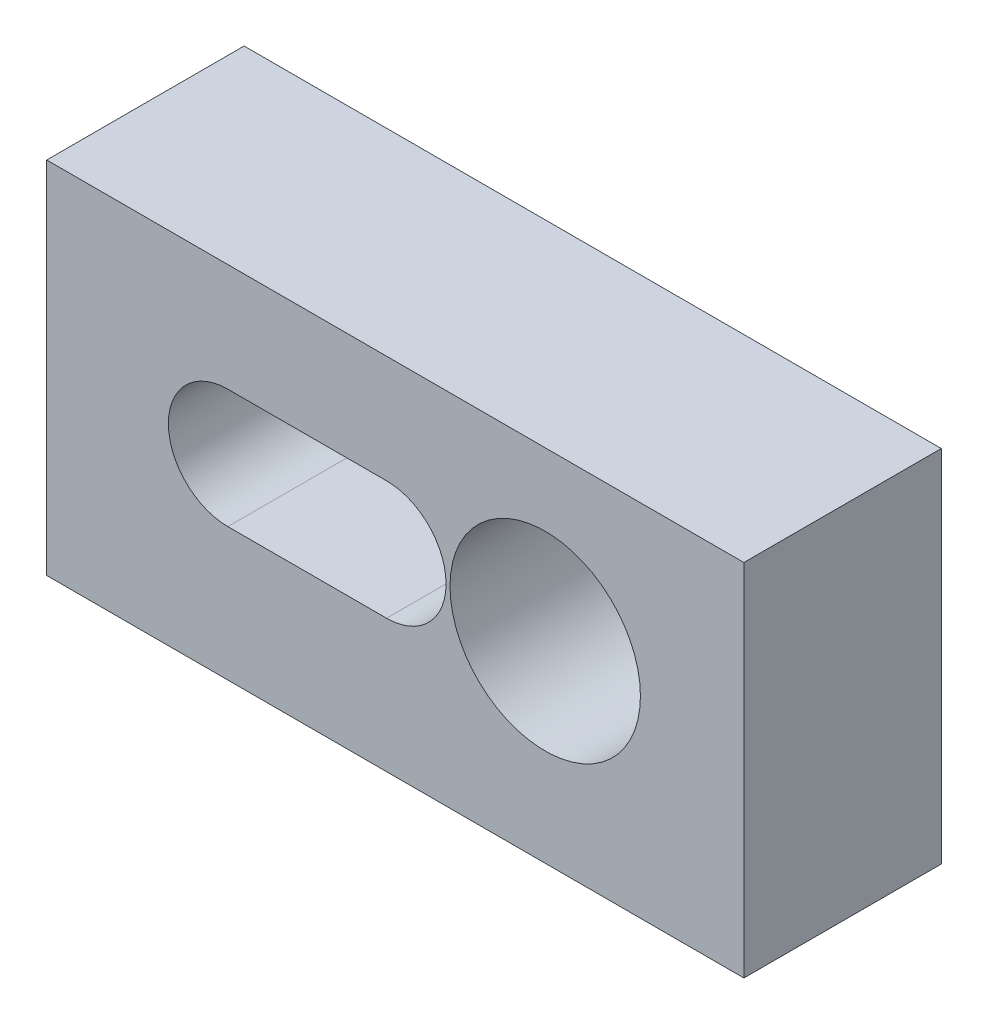
ISO-10303-21;
HEADER;
FILE_DESCRIPTION(('STEP AP214'),'2;1');
FILE_NAME('part.step','',(''),(''),'','','');
FILE_SCHEMA(('AUTOMOTIVE_DESIGN { 1 0 10303 214 1 1 1 1 }'));
ENDSEC;
DATA;
#1=APPLICATION_CONTEXT('core data for automotive mechanical design processes');
#2=APPLICATION_PROTOCOL_DEFINITION('international standard','automotive_design',2000,#1);
#3=PRODUCT_CONTEXT('',#1,'mechanical');
#4=PRODUCT('Part','Part','',(#3));
#5=PRODUCT_RELATED_PRODUCT_CATEGORY('part','',(#4));
#6=PRODUCT_DEFINITION_FORMATION('','',#4);
#7=PRODUCT_DEFINITION_CONTEXT('part definition',#1,'design');
#8=PRODUCT_DEFINITION('design','',#6,#7);
#9=PRODUCT_DEFINITION_SHAPE('','',#8);
#10=(LENGTH_UNIT() NAMED_UNIT(*) SI_UNIT(.MILLI.,.METRE.));
#11=(NAMED_UNIT(*) PLANE_ANGLE_UNIT() SI_UNIT($,.RADIAN.));
#12=(NAMED_UNIT(*) SI_UNIT($,.STERADIAN.) SOLID_ANGLE_UNIT());
#13=UNCERTAINTY_MEASURE_WITH_UNIT(LENGTH_MEASURE(1.E-05),#10,'distance_accuracy_value','');
#14=(GEOMETRIC_REPRESENTATION_CONTEXT(3) GLOBAL_UNCERTAINTY_ASSIGNED_CONTEXT((#13)) GLOBAL_UNIT_ASSIGNED_CONTEXT((#10,
#11,#12)) REPRESENTATION_CONTEXT('',''));
#15=CARTESIAN_POINT('',(0.,0.,0.));
#16=DIRECTION('',(0.,0.,1.));
#17=DIRECTION('',(1.,0.,0.));
#18=AXIS2_PLACEMENT_3D('',#15,#16,#17);
#19=CARTESIAN_POINT('',(-11.899948696282,15.4,-3.3934633027523));
#20=DIRECTION('',(0.,0.,-1.));
#21=DIRECTION('',(-1.,0.,0.));
#22=AXIS2_PLACEMENT_3D('',#19,#20,#21);
#23=CYLINDRICAL_SURFACE('',#22,1.8415);
#24=CARTESIAN_POINT('',(-11.899948696282,15.4,-12.9934633027523));
#25=DIRECTION('',(0.,0.,1.));
#26=DIRECTION('',(1.,0.,0.));
#27=AXIS2_PLACEMENT_3D('',#24,#25,#26);
#28=CIRCLE('',#27,1.8415);
#29=CARTESIAN_POINT('',(-10.058448696282,15.4,-12.9934633027523));
#30=VERTEX_POINT('',#29);
#31=EDGE_CURVE('E171',#30,#30,#28,.T.);
#32=ORIENTED_EDGE('',*,*,#31,.T.);
#33=EDGE_LOOP('',(#32));
#34=FACE_BOUND('',#33,.T.);
#35=CARTESIAN_POINT('',(-11.899948696282,15.4,-14.1884633027523));
#36=DIRECTION('',(0.,0.,-1.));
#37=DIRECTION('',(-1.,0.,0.));
#38=AXIS2_PLACEMENT_3D('',#35,#36,#37);
#39=CIRCLE('',#38,1.8415);
#40=CARTESIAN_POINT('',(-13.741448696282,15.4,-14.1884633027523));
#41=VERTEX_POINT('',#40);
#42=EDGE_CURVE('E163',#41,#41,#39,.F.);
#43=ORIENTED_EDGE('',*,*,#42,.F.);
#44=EDGE_LOOP('',(#43));
#45=FACE_BOUND('',#44,.T.);
#46=ADVANCED_FACE('F33',(#34,#45),#23,.F.);
#47=CARTESIAN_POINT('',(-24.599948696282,15.4,-3.3934633027523));
#48=DIRECTION('',(0.,0.,-1.));
#49=DIRECTION('',(-1.,0.,0.));
#50=AXIS2_PLACEMENT_3D('',#47,#48,#49);
#51=CYLINDRICAL_SURFACE('',#50,1.8415);
#52=CARTESIAN_POINT('',(-24.599948696282,15.4,-12.9934633027523));
#53=DIRECTION('',(0.,0.,1.));
#54=DIRECTION('',(1.,0.,0.));
#55=AXIS2_PLACEMENT_3D('',#52,#53,#54);
#56=CIRCLE('',#55,1.8415);
#57=CARTESIAN_POINT('',(-22.758448696282,15.4,-12.9934633027523));
#58=VERTEX_POINT('',#57);
#59=EDGE_CURVE('E166',#58,#58,#56,.T.);
#60=ORIENTED_EDGE('',*,*,#59,.T.);
#61=EDGE_LOOP('',(#60));
#62=FACE_BOUND('',#61,.T.);
#63=CARTESIAN_POINT('',(-24.599948696282,15.4,-14.1884633027523));
#64=DIRECTION('',(0.,0.,-1.));
#65=DIRECTION('',(-1.,0.,0.));
#66=AXIS2_PLACEMENT_3D('',#63,#64,#65);
#67=CIRCLE('',#66,1.8415);
#68=CARTESIAN_POINT('',(-26.441448696282,15.4,-14.1884633027523));
#69=VERTEX_POINT('',#68);
#70=EDGE_CURVE('E37',#69,#69,#67,.F.);
#71=ORIENTED_EDGE('',*,*,#70,.F.);
#72=EDGE_LOOP('',(#71));
#73=FACE_BOUND('',#72,.T.);
#74=ADVANCED_FACE('F240',(#62,#73),#51,.F.);
#75=CARTESIAN_POINT('',(-39.099948696282,28.8,-16.0934633027523));
#76=DIRECTION('',(1.,0.,0.));
#77=DIRECTION('',(0.,0.,-1.));
#78=AXIS2_PLACEMENT_3D('',#75,#76,#77);
#79=PLANE('',#78);
#80=DIRECTION('',(0.,0.,1.));
#81=VECTOR('',#80,1.);
#82=CARTESIAN_POINT('',(-39.099948696282,0.,-16.0934633027523));
#83=LINE('',#82,#81);
#84=CARTESIAN_POINT('',(-39.099948696282,0.,-16.0934633027523));
#85=VERTEX_POINT('',#84);
#86=CARTESIAN_POINT('',(-39.099948696282,0.,-0.293463302752296));
#87=VERTEX_POINT('',#86);
#88=EDGE_CURVE('E206',#85,#87,#83,.T.);
#89=ORIENTED_EDGE('',*,*,#88,.T.);
#90=DIRECTION('',(0.,-1.,0.));
#91=VECTOR('',#90,1.);
#92=CARTESIAN_POINT('',(-39.099948696282,28.8,-0.293463302752296));
#93=LINE('',#92,#91);
#94=CARTESIAN_POINT('',(-39.099948696282,28.8,-0.293463302752296));
#95=VERTEX_POINT('',#94);
#96=EDGE_CURVE('E11',#95,#87,#93,.T.);
#97=ORIENTED_EDGE('',*,*,#96,.F.);
#98=DIRECTION('',(0.,0.,1.));
#99=VECTOR('',#98,1.);
#100=CARTESIAN_POINT('',(-39.099948696282,28.8,-16.0934633027523));
#101=LINE('',#100,#99);
#102=CARTESIAN_POINT('',(-39.099948696282,28.8,-16.0934633027523));
#103=VERTEX_POINT('',#102);
#104=EDGE_CURVE('E209',#103,#95,#101,.T.);
#105=ORIENTED_EDGE('',*,*,#104,.F.);
#106=DIRECTION('',(0.,-1.,0.));
#107=VECTOR('',#106,1.);
#108=CARTESIAN_POINT('',(-39.099948696282,28.8,-16.0934633027523));
#109=LINE('',#108,#107);
#110=EDGE_CURVE('E219',#103,#85,#109,.T.);
#111=ORIENTED_EDGE('',*,*,#110,.T.);
#112=EDGE_LOOP('',(#89,#97,#105,#111));
#113=FACE_BOUND('',#112,.T.);
#114=ADVANCED_FACE('F35',(#113),#79,.F.);
#115=CARTESIAN_POINT('',(-39.099948696282,28.8,-0.293463302752296));
#116=DIRECTION('',(0.,0.,-1.));
#117=DIRECTION('',(-1.,0.,0.));
#118=AXIS2_PLACEMENT_3D('',#115,#116,#117);
#119=PLANE('',#118);
#120=DIRECTION('',(-1.,0.,0.));
#121=VECTOR('',#120,1.);
#122=CARTESIAN_POINT('',(-11.899948696282,20.1625,-0.293463302752296));
#123=LINE('',#122,#121);
#124=CARTESIAN_POINT('',(-11.899948696282,20.1625,-0.293463302752296));
#125=VERTEX_POINT('',#124);
#126=CARTESIAN_POINT('',(-24.599948696282,20.1625,-0.293463302752296));
#127=VERTEX_POINT('',#126);
#128=EDGE_CURVE('E187',#125,#127,#123,.T.);
#129=ORIENTED_EDGE('',*,*,#128,.F.);
#130=CARTESIAN_POINT('',(-11.899948696282,15.4,-0.293463302752296));
#131=DIRECTION('',(0.,0.,1.));
#132=DIRECTION('',(1.,0.,0.));
#133=AXIS2_PLACEMENT_3D('',#130,#131,#132);
#134=CIRCLE('',#133,4.7625);
#135=CARTESIAN_POINT('',(-11.899948696282,10.6375,-0.293463302752296));
#136=VERTEX_POINT('',#135);
#137=EDGE_CURVE('E58',#136,#125,#134,.T.);
#138=ORIENTED_EDGE('',*,*,#137,.F.);
#139=DIRECTION('',(1.,0.,0.));
#140=VECTOR('',#139,1.);
#141=CARTESIAN_POINT('',(-11.899948696282,10.6375,-0.293463302752296));
#142=LINE('',#141,#140);
#143=CARTESIAN_POINT('',(-24.599948696282,10.6375,-0.293463302752296));
#144=VERTEX_POINT('',#143);
#145=EDGE_CURVE('E176',#144,#136,#142,.T.);
#146=ORIENTED_EDGE('',*,*,#145,.F.);
#147=CARTESIAN_POINT('',(-24.599948696282,15.4,-0.293463302752296));
#148=DIRECTION('',(0.,0.,1.));
#149=DIRECTION('',(1.,0.,0.));
#150=AXIS2_PLACEMENT_3D('',#147,#148,#149);
#151=CIRCLE('',#150,4.7625);
#152=EDGE_CURVE('E190',#127,#144,#151,.T.);
#153=ORIENTED_EDGE('',*,*,#152,.F.);
#154=EDGE_LOOP('',(#129,#138,#146,#153));
#155=FACE_BOUND('',#154,.T.);
#156=CARTESIAN_POINT('',(0.800051303717998,15.4,-0.293463302752296));
#157=DIRECTION('',(0.,0.,1.));
#158=DIRECTION('',(1.,0.,0.));
#159=AXIS2_PLACEMENT_3D('',#156,#157,#158);
#160=CIRCLE('',#159,7.62);
#161=CARTESIAN_POINT('',(8.420051303718,15.4,-0.293463302752296));
#162=VERTEX_POINT('',#161);
#163=EDGE_CURVE('E197',#162,#162,#160,.T.);
#164=ORIENTED_EDGE('',*,*,#163,.F.);
#165=EDGE_LOOP('',(#164));
#166=FACE_BOUND('',#165,.T.);
#167=DIRECTION('',(1.,0.,0.));
#168=VECTOR('',#167,1.);
#169=CARTESIAN_POINT('',(-39.099948696282,0.,-0.293463302752296));
#170=LINE('',#169,#168);
#171=CARTESIAN_POINT('',(16.700051303718,0.,-0.293463302752296));
#172=VERTEX_POINT('',#171);
#173=EDGE_CURVE('E222',#87,#172,#170,.T.);
#174=ORIENTED_EDGE('',*,*,#173,.T.);
#175=DIRECTION('',(0.,-1.,0.));
#176=VECTOR('',#175,1.);
#177=CARTESIAN_POINT('',(16.700051303718,28.8,-0.293463302752296));
#178=LINE('',#177,#176);
#179=CARTESIAN_POINT('',(16.700051303718,28.8,-0.293463302752296));
#180=VERTEX_POINT('',#179);
#181=EDGE_CURVE('E42',#180,#172,#178,.T.);
#182=ORIENTED_EDGE('',*,*,#181,.F.);
#183=DIRECTION('',(1.,0.,0.));
#184=VECTOR('',#183,1.);
#185=CARTESIAN_POINT('',(-39.099948696282,28.8,-0.293463302752296));
#186=LINE('',#185,#184);
#187=EDGE_CURVE('E212',#95,#180,#186,.T.);
#188=ORIENTED_EDGE('',*,*,#187,.F.);
#189=ORIENTED_EDGE('',*,*,#96,.T.);
#190=EDGE_LOOP('',(#174,#182,#188,#189));
#191=FACE_BOUND('',#190,.T.);
#192=ADVANCED_FACE('F265',(#155,#166,#191),#119,.F.);
#193=CARTESIAN_POINT('',(16.700051303718,28.8,-16.0934633027523));
#194=DIRECTION('',(-1.,0.,0.));
#195=DIRECTION('',(0.,0.,1.));
#196=AXIS2_PLACEMENT_3D('',#193,#194,#195);
#197=PLANE('',#196);
#198=DIRECTION('',(0.,0.,-1.));
#199=VECTOR('',#198,1.);
#200=CARTESIAN_POINT('',(16.700051303718,0.,-16.0934633027523));
#201=LINE('',#200,#199);
#202=CARTESIAN_POINT('',(16.700051303718,0.,-16.0934633027523));
#203=VERTEX_POINT('',#202);
#204=EDGE_CURVE('E224',#172,#203,#201,.T.);
#205=ORIENTED_EDGE('',*,*,#204,.T.);
#206=DIRECTION('',(0.,-1.,0.));
#207=VECTOR('',#206,1.);
#208=CARTESIAN_POINT('',(16.700051303718,28.8,-16.0934633027523));
#209=LINE('',#208,#207);
#210=CARTESIAN_POINT('',(16.700051303718,28.8,-16.0934633027523));
#211=VERTEX_POINT('',#210);
#212=EDGE_CURVE('E229',#211,#203,#209,.T.);
#213=ORIENTED_EDGE('',*,*,#212,.F.);
#214=DIRECTION('',(0.,0.,-1.));
#215=VECTOR('',#214,1.);
#216=CARTESIAN_POINT('',(16.700051303718,28.8,-16.0934633027523));
#217=LINE('',#216,#215);
#218=EDGE_CURVE('E215',#180,#211,#217,.T.);
#219=ORIENTED_EDGE('',*,*,#218,.F.);
#220=ORIENTED_EDGE('',*,*,#181,.T.);
#221=EDGE_LOOP('',(#205,#213,#219,#220));
#222=FACE_BOUND('',#221,.T.);
#223=ADVANCED_FACE('F268',(#222),#197,.F.);
#224=CARTESIAN_POINT('',(-39.099948696282,28.8,-16.0934633027523));
#225=DIRECTION('',(0.,0.,1.));
#226=DIRECTION('',(1.,0.,0.));
#227=AXIS2_PLACEMENT_3D('',#224,#225,#226);
#228=PLANE('',#227);
#229=DIRECTION('',(-1.,0.,0.));
#230=VECTOR('',#229,1.);
#231=CARTESIAN_POINT('',(-11.899948696282,10.6375,-16.0934633027523));
#232=LINE('',#231,#230);
#233=CARTESIAN_POINT('',(-11.899948696282,10.6375,-16.0934633027523));
#234=VERTEX_POINT('',#233);
#235=CARTESIAN_POINT('',(-24.599948696282,10.6375,-16.0934633027523));
#236=VERTEX_POINT('',#235);
#237=EDGE_CURVE('E154',#234,#236,#232,.T.);
#238=ORIENTED_EDGE('',*,*,#237,.F.);
#239=CARTESIAN_POINT('',(-11.899948696282,15.4,-16.0934633027523));
#240=DIRECTION('',(0.,0.,-1.));
#241=DIRECTION('',(-1.,0.,0.));
#242=AXIS2_PLACEMENT_3D('',#239,#240,#241);
#243=CIRCLE('',#242,4.7625);
#244=CARTESIAN_POINT('',(-11.899948696282,20.1625,-16.0934633027523));
#245=VERTEX_POINT('',#244);
#246=EDGE_CURVE('E50',#245,#234,#243,.T.);
#247=ORIENTED_EDGE('',*,*,#246,.F.);
#248=DIRECTION('',(1.,0.,0.));
#249=VECTOR('',#248,1.);
#250=CARTESIAN_POINT('',(-24.599948696282,20.1625,-16.0934633027523));
#251=LINE('',#250,#249);
#252=CARTESIAN_POINT('',(-24.599948696282,20.1625,-16.0934633027523));
#253=VERTEX_POINT('',#252);
#254=EDGE_CURVE('E145',#253,#245,#251,.T.);
#255=ORIENTED_EDGE('',*,*,#254,.F.);
#256=CARTESIAN_POINT('',(-24.599948696282,15.4,-16.0934633027523));
#257=DIRECTION('',(0.,0.,-1.));
#258=DIRECTION('',(-1.,0.,0.));
#259=AXIS2_PLACEMENT_3D('',#256,#257,#258);
#260=CIRCLE('',#259,4.7625);
#261=EDGE_CURVE('E148',#236,#253,#260,.T.);
#262=ORIENTED_EDGE('',*,*,#261,.F.);
#263=EDGE_LOOP('',(#238,#247,#255,#262));
#264=FACE_BOUND('',#263,.T.);
#265=CARTESIAN_POINT('',(0.800051303717995,15.4,-16.0934633027523));
#266=DIRECTION('',(0.,0.,-1.));
#267=DIRECTION('',(-1.,0.,0.));
#268=AXIS2_PLACEMENT_3D('',#265,#266,#267);
#269=CIRCLE('',#268,2.778125);
#270=CARTESIAN_POINT('',(-1.97807369628201,15.4,-16.0934633027523));
#271=VERTEX_POINT('',#270);
#272=EDGE_CURVE('E167',#271,#271,#269,.T.);
#273=ORIENTED_EDGE('',*,*,#272,.F.);
#274=EDGE_LOOP('',(#273));
#275=FACE_BOUND('',#274,.T.);
#276=DIRECTION('',(-1.,0.,0.));
#277=VECTOR('',#276,1.);
#278=CARTESIAN_POINT('',(-39.099948696282,0.,-16.0934633027523));
#279=LINE('',#278,#277);
#280=EDGE_CURVE('E213',#203,#85,#279,.T.);
#281=ORIENTED_EDGE('',*,*,#280,.T.);
#282=ORIENTED_EDGE('',*,*,#110,.F.);
#283=DIRECTION('',(-1.,0.,0.));
#284=VECTOR('',#283,1.);
#285=CARTESIAN_POINT('',(-39.099948696282,28.8,-16.0934633027523));
#286=LINE('',#285,#284);
#287=EDGE_CURVE('E217',#211,#103,#286,.T.);
#288=ORIENTED_EDGE('',*,*,#287,.F.);
#289=ORIENTED_EDGE('',*,*,#212,.T.);
#290=EDGE_LOOP('',(#281,#282,#288,#289));
#291=FACE_BOUND('',#290,.T.);
#292=ADVANCED_FACE('F283',(#264,#275,#291),#228,.F.);
#293=CARTESIAN_POINT('',(-39.099948696282,28.8,-0.293463302752296));
#294=DIRECTION('',(0.,1.,0.));
#295=DIRECTION('',(0.,0.,1.));
#296=AXIS2_PLACEMENT_3D('',#293,#294,#295);
#297=PLANE('',#296);
#298=ORIENTED_EDGE('',*,*,#104,.T.);
#299=ORIENTED_EDGE('',*,*,#187,.T.);
#300=ORIENTED_EDGE('',*,*,#218,.T.);
#301=ORIENTED_EDGE('',*,*,#287,.T.);
#302=EDGE_LOOP('',(#298,#299,#300,#301));
#303=FACE_BOUND('',#302,.T.);
#304=ADVANCED_FACE('F288',(#303),#297,.T.);
#305=CARTESIAN_POINT('',(-39.099948696282,0.,-0.293463302752296));
#306=DIRECTION('',(0.,1.,0.));
#307=DIRECTION('',(0.,0.,1.));
#308=AXIS2_PLACEMENT_3D('',#305,#306,#307);
#309=PLANE('',#308);
#310=ORIENTED_EDGE('',*,*,#88,.F.);
#311=ORIENTED_EDGE('',*,*,#280,.F.);
#312=ORIENTED_EDGE('',*,*,#204,.F.);
#313=ORIENTED_EDGE('',*,*,#173,.F.);
#314=EDGE_LOOP('',(#310,#311,#312,#313));
#315=FACE_BOUND('',#314,.T.);
#316=ADVANCED_FACE('F280',(#315),#309,.F.);
#317=CARTESIAN_POINT('',(0.800051303717998,15.4,-12.9934633027523));
#318=DIRECTION('',(0.,0.,1.));
#319=DIRECTION('',(1.,0.,0.));
#320=AXIS2_PLACEMENT_3D('',#317,#318,#319);
#321=CYLINDRICAL_SURFACE('',#320,7.62);
#322=CARTESIAN_POINT('',(0.800051303717998,15.4,-12.9934633027523));
#323=DIRECTION('',(0.,0.,1.));
#324=DIRECTION('',(1.,0.,0.));
#325=AXIS2_PLACEMENT_3D('',#322,#323,#324);
#326=CIRCLE('',#325,7.62);
#327=CARTESIAN_POINT('',(8.420051303718,15.4,-12.9934633027523));
#328=VERTEX_POINT('',#327);
#329=EDGE_CURVE('E203',#328,#328,#326,.T.);
#330=ORIENTED_EDGE('',*,*,#329,.F.);
#331=EDGE_LOOP('',(#330));
#332=FACE_BOUND('',#331,.T.);
#333=ORIENTED_EDGE('',*,*,#163,.T.);
#334=EDGE_LOOP('',(#333));
#335=FACE_BOUND('',#334,.T.);
#336=ADVANCED_FACE('F295',(#332,#335),#321,.F.);
#337=CARTESIAN_POINT('',(0.800051303717998,15.4,-12.9934633027523));
#338=DIRECTION('',(0.,0.,1.));
#339=DIRECTION('',(1.,0.,0.));
#340=AXIS2_PLACEMENT_3D('',#337,#338,#339);
#341=PLANE('',#340);
#342=CARTESIAN_POINT('',(0.800051303717995,15.4,-12.9934633027523));
#343=DIRECTION('',(0.,0.,1.));
#344=DIRECTION('',(1.,0.,0.));
#345=AXIS2_PLACEMENT_3D('',#342,#343,#344);
#346=CIRCLE('',#345,2.778125);
#347=CARTESIAN_POINT('',(3.578176303718,15.4,-12.9934633027523));
#348=VERTEX_POINT('',#347);
#349=EDGE_CURVE('E170',#348,#348,#346,.T.);
#350=ORIENTED_EDGE('',*,*,#349,.F.);
#351=EDGE_LOOP('',(#350));
#352=FACE_BOUND('',#351,.T.);
#353=ORIENTED_EDGE('',*,*,#329,.T.);
#354=EDGE_LOOP('',(#353));
#355=FACE_BOUND('',#354,.T.);
#356=ADVANCED_FACE('F321',(#352,#355),#341,.T.);
#357=CARTESIAN_POINT('',(-11.899948696282,15.4,-12.9934633027523));
#358=DIRECTION('',(0.,0.,1.));
#359=DIRECTION('',(1.,0.,0.));
#360=AXIS2_PLACEMENT_3D('',#357,#358,#359);
#361=CYLINDRICAL_SURFACE('',#360,4.7625);
#362=ORIENTED_EDGE('',*,*,#137,.T.);
#363=DIRECTION('',(0.,0.,1.));
#364=VECTOR('',#363,1.);
#365=CARTESIAN_POINT('',(-11.899948696282,20.1625,-12.9934633027523));
#366=LINE('',#365,#364);
#367=CARTESIAN_POINT('',(-11.899948696282,20.1625,-12.9934633027523));
#368=VERTEX_POINT('',#367);
#369=EDGE_CURVE('E185',#368,#125,#366,.T.);
#370=ORIENTED_EDGE('',*,*,#369,.F.);
#371=CARTESIAN_POINT('',(-11.899948696282,15.4,-12.9934633027523));
#372=DIRECTION('',(0.,0.,1.));
#373=DIRECTION('',(1.,0.,0.));
#374=AXIS2_PLACEMENT_3D('',#371,#372,#373);
#375=CIRCLE('',#374,4.7625);
#376=CARTESIAN_POINT('',(-11.899948696282,10.6375,-12.9934633027523));
#377=VERTEX_POINT('',#376);
#378=EDGE_CURVE('E172',#377,#368,#375,.T.);
#379=ORIENTED_EDGE('',*,*,#378,.F.);
#380=DIRECTION('',(0.,0.,1.));
#381=VECTOR('',#380,1.);
#382=CARTESIAN_POINT('',(-11.899948696282,10.6375,-12.9934633027523));
#383=LINE('',#382,#381);
#384=EDGE_CURVE('E195',#377,#136,#383,.T.);
#385=ORIENTED_EDGE('',*,*,#384,.T.);
#386=EDGE_LOOP('',(#362,#370,#379,#385));
#387=FACE_BOUND('',#386,.T.);
#388=ADVANCED_FACE('F254',(#387),#361,.F.);
#389=CARTESIAN_POINT('',(-11.899948696282,10.6375,-12.9934633027523));
#390=DIRECTION('',(0.,-1.,0.));
#391=DIRECTION('',(1.,0.,0.));
#392=AXIS2_PLACEMENT_3D('',#389,#390,#391);
#393=PLANE('',#392);
#394=ORIENTED_EDGE('',*,*,#145,.T.);
#395=ORIENTED_EDGE('',*,*,#384,.F.);
#396=DIRECTION('',(1.,0.,0.));
#397=VECTOR('',#396,1.);
#398=CARTESIAN_POINT('',(-11.899948696282,10.6375,-12.9934633027523));
#399=LINE('',#398,#397);
#400=CARTESIAN_POINT('',(-24.599948696282,10.6375,-12.9934633027523));
#401=VERTEX_POINT('',#400);
#402=EDGE_CURVE('E182',#401,#377,#399,.T.);
#403=ORIENTED_EDGE('',*,*,#402,.F.);
#404=DIRECTION('',(0.,0.,1.));
#405=VECTOR('',#404,1.);
#406=CARTESIAN_POINT('',(-24.599948696282,10.6375,-12.9934633027523));
#407=LINE('',#406,#405);
#408=EDGE_CURVE('E198',#401,#144,#407,.T.);
#409=ORIENTED_EDGE('',*,*,#408,.T.);
#410=EDGE_LOOP('',(#394,#395,#403,#409));
#411=FACE_BOUND('',#410,.T.);
#412=ADVANCED_FACE('F262',(#411),#393,.F.);
#413=CARTESIAN_POINT('',(-24.599948696282,15.4,-12.9934633027523));
#414=DIRECTION('',(0.,0.,1.));
#415=DIRECTION('',(1.,0.,0.));
#416=AXIS2_PLACEMENT_3D('',#413,#414,#415);
#417=CYLINDRICAL_SURFACE('',#416,4.7625);
#418=ORIENTED_EDGE('',*,*,#152,.T.);
#419=ORIENTED_EDGE('',*,*,#408,.F.);
#420=CARTESIAN_POINT('',(-24.599948696282,15.4,-12.9934633027523));
#421=DIRECTION('',(0.,0.,1.));
#422=DIRECTION('',(1.,0.,0.));
#423=AXIS2_PLACEMENT_3D('',#420,#421,#422);
#424=CIRCLE('',#423,4.7625);
#425=CARTESIAN_POINT('',(-24.599948696282,20.1625,-12.9934633027523));
#426=VERTEX_POINT('',#425);
#427=EDGE_CURVE('E179',#426,#401,#424,.T.);
#428=ORIENTED_EDGE('',*,*,#427,.F.);
#429=DIRECTION('',(0.,0.,1.));
#430=VECTOR('',#429,1.);
#431=CARTESIAN_POINT('',(-24.599948696282,20.1625,-12.9934633027523));
#432=LINE('',#431,#430);
#433=EDGE_CURVE('E200',#426,#127,#432,.T.);
#434=ORIENTED_EDGE('',*,*,#433,.T.);
#435=EDGE_LOOP('',(#418,#419,#428,#434));
#436=FACE_BOUND('',#435,.T.);
#437=ADVANCED_FACE('F260',(#436),#417,.F.);
#438=CARTESIAN_POINT('',(-11.899948696282,20.1625,-12.9934633027523));
#439=DIRECTION('',(0.,1.,0.));
#440=DIRECTION('',(-1.,0.,0.));
#441=AXIS2_PLACEMENT_3D('',#438,#439,#440);
#442=PLANE('',#441);
#443=ORIENTED_EDGE('',*,*,#128,.T.);
#444=ORIENTED_EDGE('',*,*,#433,.F.);
#445=DIRECTION('',(-1.,0.,0.));
#446=VECTOR('',#445,1.);
#447=CARTESIAN_POINT('',(-11.899948696282,20.1625,-12.9934633027523));
#448=LINE('',#447,#446);
#449=EDGE_CURVE('E175',#368,#426,#448,.T.);
#450=ORIENTED_EDGE('',*,*,#449,.F.);
#451=ORIENTED_EDGE('',*,*,#369,.T.);
#452=EDGE_LOOP('',(#443,#444,#450,#451));
#453=FACE_BOUND('',#452,.T.);
#454=ADVANCED_FACE('F247',(#453),#442,.F.);
#455=CARTESIAN_POINT('',(-11.899948696282,15.4,-12.9934633027523));
#456=DIRECTION('',(0.,0.,1.));
#457=DIRECTION('',(1.,0.,0.));
#458=AXIS2_PLACEMENT_3D('',#455,#456,#457);
#459=PLANE('',#458);
#460=ORIENTED_EDGE('',*,*,#59,.F.);
#461=EDGE_LOOP('',(#460));
#462=FACE_BOUND('',#461,.T.);
#463=ORIENTED_EDGE('',*,*,#31,.F.);
#464=EDGE_LOOP('',(#463));
#465=FACE_BOUND('',#464,.T.);
#466=ORIENTED_EDGE('',*,*,#378,.T.);
#467=ORIENTED_EDGE('',*,*,#449,.T.);
#468=ORIENTED_EDGE('',*,*,#427,.T.);
#469=ORIENTED_EDGE('',*,*,#402,.T.);
#470=EDGE_LOOP('',(#466,#467,#468,#469));
#471=FACE_BOUND('',#470,.T.);
#472=ADVANCED_FACE('F243',(#462,#465,#471),#459,.T.);
#473=CARTESIAN_POINT('',(0.800051303717995,15.4,-3.3934633027523));
#474=DIRECTION('',(0.,0.,-1.));
#475=DIRECTION('',(-1.,0.,0.));
#476=AXIS2_PLACEMENT_3D('',#473,#474,#475);
#477=CYLINDRICAL_SURFACE('',#476,2.778125);
#478=ORIENTED_EDGE('',*,*,#349,.T.);
#479=EDGE_LOOP('',(#478));
#480=FACE_BOUND('',#479,.T.);
#481=ORIENTED_EDGE('',*,*,#272,.T.);
#482=EDGE_LOOP('',(#481));
#483=FACE_BOUND('',#482,.T.);
#484=ADVANCED_FACE('F246',(#480,#483),#477,.F.);
#485=CARTESIAN_POINT('',(-11.899948696282,15.4,-14.1884633027523));
#486=DIRECTION('',(0.,0.,-1.));
#487=DIRECTION('',(-1.,0.,0.));
#488=AXIS2_PLACEMENT_3D('',#485,#486,#487);
#489=PLANE('',#488);
#490=ORIENTED_EDGE('',*,*,#70,.T.);
#491=EDGE_LOOP('',(#490));
#492=FACE_BOUND('',#491,.T.);
#493=CARTESIAN_POINT('',(-11.899948696282,15.4,-14.1884633027523));
#494=DIRECTION('',(0.,0.,-1.));
#495=DIRECTION('',(-1.,0.,0.));
#496=AXIS2_PLACEMENT_3D('',#493,#494,#495);
#497=CIRCLE('',#496,4.7625);
#498=CARTESIAN_POINT('',(-11.899948696282,20.1625,-14.1884633027523));
#499=VERTEX_POINT('',#498);
#500=CARTESIAN_POINT('',(-11.899948696282,10.6375,-14.1884633027523));
#501=VERTEX_POINT('',#500);
#502=EDGE_CURVE('E126',#499,#501,#497,.T.);
#503=ORIENTED_EDGE('',*,*,#502,.T.);
#504=DIRECTION('',(-1.,0.,0.));
#505=VECTOR('',#504,1.);
#506=CARTESIAN_POINT('',(-11.899948696282,10.6375,-14.1884633027523));
#507=LINE('',#506,#505);
#508=CARTESIAN_POINT('',(-24.599948696282,10.6375,-14.1884633027523));
#509=VERTEX_POINT('',#508);
#510=EDGE_CURVE('E135',#501,#509,#507,.T.);
#511=ORIENTED_EDGE('',*,*,#510,.T.);
#512=CARTESIAN_POINT('',(-24.599948696282,15.4,-14.1884633027523));
#513=DIRECTION('',(0.,0.,-1.));
#514=DIRECTION('',(-1.,0.,0.));
#515=AXIS2_PLACEMENT_3D('',#512,#513,#514);
#516=CIRCLE('',#515,4.7625);
#517=CARTESIAN_POINT('',(-24.599948696282,20.1625,-14.1884633027523));
#518=VERTEX_POINT('',#517);
#519=EDGE_CURVE('E140',#509,#518,#516,.T.);
#520=ORIENTED_EDGE('',*,*,#519,.T.);
#521=DIRECTION('',(1.,0.,0.));
#522=VECTOR('',#521,1.);
#523=CARTESIAN_POINT('',(-24.599948696282,20.1625,-14.1884633027523));
#524=LINE('',#523,#522);
#525=EDGE_CURVE('E132',#518,#499,#524,.T.);
#526=ORIENTED_EDGE('',*,*,#525,.T.);
#527=EDGE_LOOP('',(#503,#511,#520,#526));
#528=FACE_BOUND('',#527,.T.);
#529=ORIENTED_EDGE('',*,*,#42,.T.);
#530=EDGE_LOOP('',(#529));
#531=FACE_BOUND('',#530,.T.);
#532=ADVANCED_FACE('F142',(#492,#528,#531),#489,.T.);
#533=CARTESIAN_POINT('',(-11.899948696282,15.4,-14.1884633027523));
#534=DIRECTION('',(0.,0.,-1.));
#535=DIRECTION('',(-1.,0.,0.));
#536=AXIS2_PLACEMENT_3D('',#533,#534,#535);
#537=CYLINDRICAL_SURFACE('',#536,4.7625);
#538=ORIENTED_EDGE('',*,*,#246,.T.);
#539=DIRECTION('',(0.,0.,-1.));
#540=VECTOR('',#539,1.);
#541=CARTESIAN_POINT('',(-11.899948696282,10.6375,-14.1884633027523));
#542=LINE('',#541,#540);
#543=EDGE_CURVE('E122',#501,#234,#542,.T.);
#544=ORIENTED_EDGE('',*,*,#543,.F.);
#545=ORIENTED_EDGE('',*,*,#502,.F.);
#546=DIRECTION('',(0.,0.,-1.));
#547=VECTOR('',#546,1.);
#548=CARTESIAN_POINT('',(-11.899948696282,20.1625,-14.1884633027523));
#549=LINE('',#548,#547);
#550=EDGE_CURVE('E158',#499,#245,#549,.T.);
#551=ORIENTED_EDGE('',*,*,#550,.T.);
#552=EDGE_LOOP('',(#538,#544,#545,#551));
#553=FACE_BOUND('',#552,.T.);
#554=ADVANCED_FACE('F124',(#553),#537,.F.);
#555=CARTESIAN_POINT('',(-24.599948696282,20.1625,-14.1884633027523));
#556=DIRECTION('',(0.,1.,0.));
#557=DIRECTION('',(-1.,0.,0.));
#558=AXIS2_PLACEMENT_3D('',#555,#556,#557);
#559=PLANE('',#558);
#560=ORIENTED_EDGE('',*,*,#254,.T.);
#561=ORIENTED_EDGE('',*,*,#550,.F.);
#562=ORIENTED_EDGE('',*,*,#525,.F.);
#563=DIRECTION('',(0.,0.,-1.));
#564=VECTOR('',#563,1.);
#565=CARTESIAN_POINT('',(-24.599948696282,20.1625,-14.1884633027523));
#566=LINE('',#565,#564);
#567=EDGE_CURVE('E160',#518,#253,#566,.T.);
#568=ORIENTED_EDGE('',*,*,#567,.T.);
#569=EDGE_LOOP('',(#560,#561,#562,#568));
#570=FACE_BOUND('',#569,.T.);
#571=ADVANCED_FACE('F376',(#570),#559,.F.);
#572=CARTESIAN_POINT('',(-24.599948696282,15.4,-14.1884633027523));
#573=DIRECTION('',(0.,0.,-1.));
#574=DIRECTION('',(-1.,0.,0.));
#575=AXIS2_PLACEMENT_3D('',#572,#573,#574);
#576=CYLINDRICAL_SURFACE('',#575,4.7625);
#577=ORIENTED_EDGE('',*,*,#261,.T.);
#578=ORIENTED_EDGE('',*,*,#567,.F.);
#579=ORIENTED_EDGE('',*,*,#519,.F.);
#580=DIRECTION('',(0.,0.,-1.));
#581=VECTOR('',#580,1.);
#582=CARTESIAN_POINT('',(-24.599948696282,10.6375,-14.1884633027523));
#583=LINE('',#582,#581);
#584=EDGE_CURVE('E131',#509,#236,#583,.T.);
#585=ORIENTED_EDGE('',*,*,#584,.T.);
#586=EDGE_LOOP('',(#577,#578,#579,#585));
#587=FACE_BOUND('',#586,.T.);
#588=ADVANCED_FACE('F382',(#587),#576,.F.);
#589=CARTESIAN_POINT('',(-11.899948696282,10.6375,-14.1884633027523));
#590=DIRECTION('',(0.,-1.,0.));
#591=DIRECTION('',(1.,0.,0.));
#592=AXIS2_PLACEMENT_3D('',#589,#590,#591);
#593=PLANE('',#592);
#594=ORIENTED_EDGE('',*,*,#237,.T.);
#595=ORIENTED_EDGE('',*,*,#584,.F.);
#596=ORIENTED_EDGE('',*,*,#510,.F.);
#597=ORIENTED_EDGE('',*,*,#543,.T.);
#598=EDGE_LOOP('',(#594,#595,#596,#597));
#599=FACE_BOUND('',#598,.T.);
#600=ADVANCED_FACE('F136',(#599),#593,.F.);
#601=CLOSED_SHELL('',(#46,#74,#114,#192,#223,#292,#304,#316,#336,#356,#388,#412,#437,#454,#472,
#484,#532,#554,#571,#588,#600));
#602=MANIFOLD_SOLID_BREP('B2',#601);
#603=ADVANCED_BREP_SHAPE_REPRESENTATION('',(#18,#602),#14);
#604=SHAPE_DEFINITION_REPRESENTATION(#9,#603);
ENDSEC;
END-ISO-10303-21;
